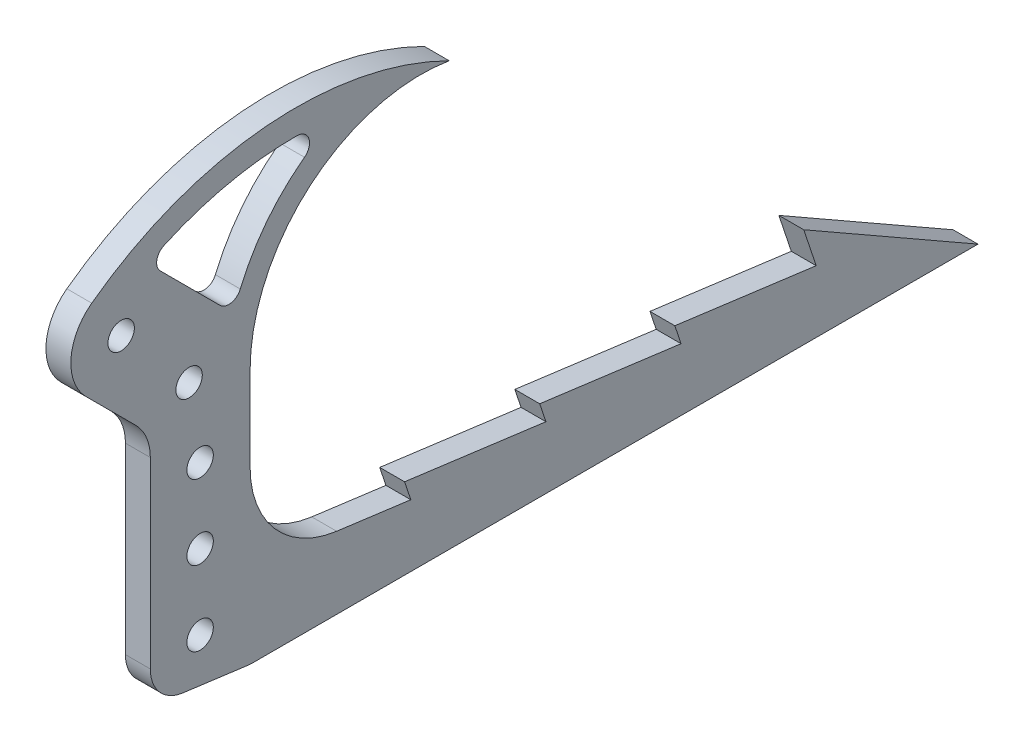
ISO-10303-21;
HEADER;
FILE_DESCRIPTION(('STEP AP214'),'2;1');
FILE_NAME('part.step','',(''),(''),'','','');
FILE_SCHEMA(('AUTOMOTIVE_DESIGN { 1 0 10303 214 1 1 1 1 }'));
ENDSEC;
DATA;
#1=APPLICATION_CONTEXT('core data for automotive mechanical design processes');
#2=APPLICATION_PROTOCOL_DEFINITION('international standard','automotive_design',2000,#1);
#3=PRODUCT_CONTEXT('',#1,'mechanical');
#4=PRODUCT('Part','Part','',(#3));
#5=PRODUCT_RELATED_PRODUCT_CATEGORY('part','',(#4));
#6=PRODUCT_DEFINITION_FORMATION('','',#4);
#7=PRODUCT_DEFINITION_CONTEXT('part definition',#1,'design');
#8=PRODUCT_DEFINITION('design','',#6,#7);
#9=PRODUCT_DEFINITION_SHAPE('','',#8);
#10=(LENGTH_UNIT() NAMED_UNIT(*) SI_UNIT(.MILLI.,.METRE.));
#11=(NAMED_UNIT(*) PLANE_ANGLE_UNIT() SI_UNIT($,.RADIAN.));
#12=(NAMED_UNIT(*) SI_UNIT($,.STERADIAN.) SOLID_ANGLE_UNIT());
#13=UNCERTAINTY_MEASURE_WITH_UNIT(LENGTH_MEASURE(1.E-05),#10,'distance_accuracy_value','');
#14=(GEOMETRIC_REPRESENTATION_CONTEXT(3) GLOBAL_UNCERTAINTY_ASSIGNED_CONTEXT((#13)) GLOBAL_UNIT_ASSIGNED_CONTEXT((#10,
#11,#12)) REPRESENTATION_CONTEXT('',''));
#15=CARTESIAN_POINT('',(0.,0.,0.));
#16=DIRECTION('',(0.,0.,1.));
#17=DIRECTION('',(1.,0.,0.));
#18=AXIS2_PLACEMENT_3D('',#15,#16,#17);
#19=CARTESIAN_POINT('',(12.7,0.,0.));
#20=DIRECTION('',(1.,0.,0.));
#21=DIRECTION('',(0.,0.,-1.));
#22=AXIS2_PLACEMENT_3D('',#19,#20,#21);
#23=PLANE('',#22);
#24=CARTESIAN_POINT('',(12.7,-234.95,-365.125));
#25=DIRECTION('',(1.,0.,0.));
#26=DIRECTION('',(0.,0.,-1.));
#27=AXIS2_PLACEMENT_3D('',#24,#25,#26);
#28=CIRCLE('',#27,6.74623999999999);
#29=CARTESIAN_POINT('',(12.7,-234.95,-371.87124));
#30=VERTEX_POINT('',#29);
#31=EDGE_CURVE('E329',#30,#30,#28,.T.);
#32=ORIENTED_EDGE('',*,*,#31,.F.);
#33=EDGE_LOOP('',(#32));
#34=FACE_BOUND('',#33,.T.);
#35=CARTESIAN_POINT('',(12.7,-196.85,-365.125));
#36=DIRECTION('',(1.,0.,0.));
#37=DIRECTION('',(0.,0.,-1.));
#38=AXIS2_PLACEMENT_3D('',#35,#36,#37);
#39=CIRCLE('',#38,6.74623999999999);
#40=CARTESIAN_POINT('',(12.7,-196.85,-371.87124));
#41=VERTEX_POINT('',#40);
#42=EDGE_CURVE('E335',#41,#41,#39,.T.);
#43=ORIENTED_EDGE('',*,*,#42,.F.);
#44=EDGE_LOOP('',(#43));
#45=FACE_BOUND('',#44,.T.);
#46=CARTESIAN_POINT('',(12.7,-158.75,-365.125));
#47=DIRECTION('',(1.,0.,0.));
#48=DIRECTION('',(0.,0.,-1.));
#49=AXIS2_PLACEMENT_3D('',#46,#47,#48);
#50=CIRCLE('',#49,6.74623999999999);
#51=CARTESIAN_POINT('',(12.7,-158.75,-371.87124));
#52=VERTEX_POINT('',#51);
#53=EDGE_CURVE('E341',#52,#52,#50,.T.);
#54=ORIENTED_EDGE('',*,*,#53,.F.);
#55=EDGE_LOOP('',(#54));
#56=FACE_BOUND('',#55,.T.);
#57=CARTESIAN_POINT('',(12.7,-120.65,-359.507120599864));
#58=DIRECTION('',(1.,0.,0.));
#59=DIRECTION('',(0.,0.,-1.));
#60=AXIS2_PLACEMENT_3D('',#57,#58,#59);
#61=CIRCLE('',#60,6.74624);
#62=CARTESIAN_POINT('',(12.7,-120.65,-366.253360599864));
#63=VERTEX_POINT('',#62);
#64=EDGE_CURVE('E345',#63,#63,#61,.T.);
#65=ORIENTED_EDGE('',*,*,#64,.F.);
#66=EDGE_LOOP('',(#65));
#67=FACE_BOUND('',#66,.T.);
#68=CARTESIAN_POINT('',(12.7,-82.55,-324.846024484277));
#69=DIRECTION('',(1.,0.,0.));
#70=DIRECTION('',(0.,0.,-1.));
#71=AXIS2_PLACEMENT_3D('',#68,#69,#70);
#72=CIRCLE('',#71,6.74624);
#73=CARTESIAN_POINT('',(12.7,-82.55,-331.592264484277));
#74=VERTEX_POINT('',#73);
#75=EDGE_CURVE('E351',#74,#74,#72,.T.);
#76=ORIENTED_EDGE('',*,*,#75,.F.);
#77=EDGE_LOOP('',(#76));
#78=FACE_BOUND('',#77,.T.);
#79=DIRECTION('',(0.,1.,0.));
#80=VECTOR('',#79,1.);
#81=CARTESIAN_POINT('',(12.7,0.,-390.630407277116));
#82=LINE('',#81,#80);
#83=CARTESIAN_POINT('',(12.7,-173.612322638782,-390.630407277116));
#84=VERTEX_POINT('',#83);
#85=CARTESIAN_POINT('',(12.7,-130.809027211395,-390.630407277116));
#86=VERTEX_POINT('',#85);
#87=EDGE_CURVE('E240',#84,#86,#82,.T.);
#88=ORIENTED_EDGE('',*,*,#87,.T.);
#89=CARTESIAN_POINT('',(12.7,-130.809027211395,-477.815853245172));
#90=DIRECTION('',(-1.,0.,0.));
#91=DIRECTION('',(0.,0.,-1.));
#92=AXIS2_PLACEMENT_3D('',#89,#90,#91);
#93=CIRCLE('',#92,87.1854459680564);
#94=CARTESIAN_POINT('',(12.7,-44.8234317857134,-492.230407277116));
#95=VERTEX_POINT('',#94);
#96=EDGE_CURVE('E223',#86,#95,#93,.T.);
#97=ORIENTED_EDGE('',*,*,#96,.T.);
#98=CARTESIAN_POINT('',(12.7,-201.477062264651,-413.996069504142));
#99=DIRECTION('',(1.,0.,0.));
#100=DIRECTION('',(0.,0.,1.));
#101=AXIS2_PLACEMENT_3D('',#98,#99,#100);
#102=CIRCLE('',#101,175.102745692371);
#103=CARTESIAN_POINT('',(12.7,-60.7181110577809,-309.842868861295));
#104=VERTEX_POINT('',#103);
#105=EDGE_CURVE('E232',#95,#104,#102,.T.);
#106=ORIENTED_EDGE('',*,*,#105,.T.);
#107=CARTESIAN_POINT('',(12.7,-81.8884049835699,-325.507619500707));
#108=DIRECTION('',(1.,0.,0.));
#109=DIRECTION('',(0.,0.,-1.));
#110=AXIS2_PLACEMENT_3D('',#107,#108,#109);
#111=CIRCLE('',#110,26.335636645034);
#112=CARTESIAN_POINT('',(12.7,-100.510512242138,-306.885512242138));
#113=VERTEX_POINT('',#112);
#114=EDGE_CURVE('E322',#104,#113,#111,.T.);
#115=ORIENTED_EDGE('',*,*,#114,.T.);
#116=DIRECTION('',(0.,-0.707106781186546,-0.707106781186549));
#117=VECTOR('',#116,1.);
#118=CARTESIAN_POINT('',(12.7,103.1875,-103.187499999999));
#119=LINE('',#118,#117);
#120=CARTESIAN_POINT('',(12.7,-125.910512242138,-332.285512242138));
#121=VERTEX_POINT('',#120);
#122=EDGE_CURVE('E355',#113,#121,#119,.T.);
#123=ORIENTED_EDGE('',*,*,#122,.T.);
#124=CARTESIAN_POINT('',(12.7,-143.871024484277,-314.325));
#125=DIRECTION('',(1.,0.,0.));
#126=DIRECTION('',(0.,0.,-1.));
#127=AXIS2_PLACEMENT_3D('',#124,#125,#126);
#128=CIRCLE('',#127,25.4);
#129=CARTESIAN_POINT('',(12.7,-143.871024484277,-339.725));
#130=VERTEX_POINT('',#129);
#131=EDGE_CURVE('E377',#121,#130,#128,.F.);
#132=ORIENTED_EDGE('',*,*,#131,.T.);
#133=DIRECTION('',(0.,-1.,0.));
#134=VECTOR('',#133,1.);
#135=CARTESIAN_POINT('',(12.7,-1.56307715309068E-13,-339.725));
#136=LINE('',#135,#134);
#137=CARTESIAN_POINT('',(12.7,-237.300627392844,-339.725));
#138=VERTEX_POINT('',#137);
#139=EDGE_CURVE('E357',#130,#138,#136,.T.);
#140=ORIENTED_EDGE('',*,*,#139,.T.);
#141=CARTESIAN_POINT('',(12.7,-237.300627392844,-358.775));
#142=DIRECTION('',(1.,0.,0.));
#143=DIRECTION('',(0.,0.,-1.));
#144=AXIS2_PLACEMENT_3D('',#141,#142,#143);
#145=CIRCLE('',#144,19.05);
#146=CARTESIAN_POINT('',(12.7,-256.186612944308,-356.280596313767));
#147=VERTEX_POINT('',#146);
#148=EDGE_CURVE('E391',#138,#147,#145,.T.);
#149=ORIENTED_EDGE('',*,*,#148,.T.);
#150=DIRECTION('',(0.,-0.130939826048985,-0.991390317662151));
#151=VECTOR('',#150,1.);
#152=CARTESIAN_POINT('',(12.7,-254.,-339.725));
#153=LINE('',#152,#151);
#154=CARTESIAN_POINT('',(12.7,-260.559417337177,-389.388597652483));
#155=VERTEX_POINT('',#154);
#156=EDGE_CURVE('E269',#147,#155,#153,.T.);
#157=ORIENTED_EDGE('',*,*,#156,.T.);
#158=CARTESIAN_POINT('',(12.7,-241.673431785713,-391.883001338717));
#159=DIRECTION('',(1.,0.,0.));
#160=DIRECTION('',(0.,0.,-1.));
#161=AXIS2_PLACEMENT_3D('',#158,#159,#160);
#162=CIRCLE('',#161,19.05);
#163=CARTESIAN_POINT('',(12.7,-260.723431785713,-391.883001338717));
#164=VERTEX_POINT('',#163);
#165=EDGE_CURVE('E393',#155,#164,#162,.T.);
#166=ORIENTED_EDGE('',*,*,#165,.T.);
#167=DIRECTION('',(0.,0.,-1.));
#168=VECTOR('',#167,1.);
#169=CARTESIAN_POINT('',(12.7,-260.723431785713,-390.630407277116));
#170=LINE('',#169,#168);
#171=CARTESIAN_POINT('',(12.7,-260.723431785713,-762.));
#172=VERTEX_POINT('',#171);
#173=EDGE_CURVE('E272',#164,#172,#170,.T.);
#174=ORIENTED_EDGE('',*,*,#173,.T.);
#175=DIRECTION('',(0.,0.496138938356834,0.868243142124459));
#176=VECTOR('',#175,1.);
#177=CARTESIAN_POINT('',(12.7,-260.723431785713,-762.));
#178=LINE('',#177,#176);
#179=CARTESIAN_POINT('',(12.7,-209.923431785713,-673.1));
#180=VERTEX_POINT('',#179);
#181=EDGE_CURVE('E275',#172,#180,#178,.T.);
#182=ORIENTED_EDGE('',*,*,#181,.T.);
#183=DIRECTION('',(0.,-0.948683298050514,-0.316227766016836));
#184=VECTOR('',#183,1.);
#185=CARTESIAN_POINT('',(12.7,-209.923431785713,-673.1));
#186=LINE('',#185,#184);
#187=CARTESIAN_POINT('',(12.7,-228.973431785713,-679.45));
#188=VERTEX_POINT('',#187);
#189=EDGE_CURVE('E278',#180,#188,#186,.T.);
#190=ORIENTED_EDGE('',*,*,#189,.T.);
#191=DIRECTION('',(0.,0.130939826048984,0.991390317662151));
#192=VECTOR('',#191,1.);
#193=CARTESIAN_POINT('',(12.7,-228.973431785713,-679.45));
#194=LINE('',#193,#192);
#195=CARTESIAN_POINT('',(12.7,-219.448431785713,-607.332959213651));
#196=VERTEX_POINT('',#195);
#197=EDGE_CURVE('E281',#188,#196,#194,.T.);
#198=ORIENTED_EDGE('',*,*,#197,.T.);
#199=DIRECTION('',(0.,-0.948683298050503,-0.31622776601687));
#200=VECTOR('',#199,1.);
#201=CARTESIAN_POINT('',(12.7,-219.448431785713,-607.332959213651));
#202=LINE('',#201,#200);
#203=CARTESIAN_POINT('',(12.7,-228.973431785713,-610.507959213651));
#204=VERTEX_POINT('',#203);
#205=EDGE_CURVE('E284',#196,#204,#202,.T.);
#206=ORIENTED_EDGE('',*,*,#205,.T.);
#207=DIRECTION('',(0.,0.130939826048984,0.991390317662152));
#208=VECTOR('',#207,1.);
#209=CARTESIAN_POINT('',(12.7,-228.973431785713,-610.507959213651));
#210=LINE('',#209,#208);
#211=CARTESIAN_POINT('',(12.7,-219.448431785713,-538.390918427302));
#212=VERTEX_POINT('',#211);
#213=EDGE_CURVE('E287',#204,#212,#210,.T.);
#214=ORIENTED_EDGE('',*,*,#213,.T.);
#215=DIRECTION('',(0.,-0.948683298050506,-0.31622776601686));
#216=VECTOR('',#215,1.);
#217=CARTESIAN_POINT('',(12.7,-219.448431785713,-538.390918427302));
#218=LINE('',#217,#216);
#219=CARTESIAN_POINT('',(12.7,-228.973431785713,-541.565918427303));
#220=VERTEX_POINT('',#219);
#221=EDGE_CURVE('E290',#212,#220,#218,.T.);
#222=ORIENTED_EDGE('',*,*,#221,.T.);
#223=DIRECTION('',(0.,0.130939826048984,0.991390317662151));
#224=VECTOR('',#223,1.);
#225=CARTESIAN_POINT('',(12.7,-228.973431785713,-541.565918427303));
#226=LINE('',#225,#224);
#227=CARTESIAN_POINT('',(12.7,-219.448431785713,-469.448877640954));
#228=VERTEX_POINT('',#227);
#229=EDGE_CURVE('E293',#220,#228,#226,.T.);
#230=ORIENTED_EDGE('',*,*,#229,.T.);
#231=DIRECTION('',(0.,-0.948683298050515,-0.316227766016835));
#232=VECTOR('',#231,1.);
#233=CARTESIAN_POINT('',(12.7,-219.448431785713,-469.448877640954));
#234=LINE('',#233,#232);
#235=CARTESIAN_POINT('',(12.7,-228.973431785713,-472.623877640954));
#236=VERTEX_POINT('',#235);
#237=EDGE_CURVE('E296',#228,#236,#234,.T.);
#238=ORIENTED_EDGE('',*,*,#237,.T.);
#239=DIRECTION('',(0.,0.130939826048984,0.991390317662151));
#240=VECTOR('',#239,1.);
#241=CARTESIAN_POINT('',(12.7,-219.448431785713,-400.506836854605));
#242=LINE('',#241,#240);
#243=CARTESIAN_POINT('',(12.7,-223.97495077602,-434.778664113827));
#244=VERTEX_POINT('',#243);
#245=EDGE_CURVE('E299',#236,#244,#242,.T.);
#246=ORIENTED_EDGE('',*,*,#245,.T.);
#247=CARTESIAN_POINT('',(12.7,-173.612322638782,-441.430407277116));
#248=DIRECTION('',(1.,0.,0.));
#249=DIRECTION('',(0.,0.,-1.));
#250=AXIS2_PLACEMENT_3D('',#247,#248,#249);
#251=CIRCLE('',#250,50.8);
#252=EDGE_CURVE('E408',#244,#84,#251,.F.);
#253=ORIENTED_EDGE('',*,*,#252,.T.);
#254=EDGE_LOOP('',(#88,#97,#106,#115,#123,#132,#140,#149,#157,#166,#174,#182,#190,#198,#206,
#214,#222,#230,#238,#246,#253));
#255=FACE_BOUND('',#254,.T.);
#256=CARTESIAN_POINT('',(12.7,-201.477062264651,-413.996069504142));
#257=DIRECTION('',(1.,0.,0.));
#258=DIRECTION('',(0.,0.,-1.));
#259=AXIS2_PLACEMENT_3D('',#256,#257,#258);
#260=CIRCLE('',#259,162.402745692371);
#261=CARTESIAN_POINT('',(12.7,-39.0755525823779,-414.629679273333));
#262=VERTEX_POINT('',#261);
#263=CARTESIAN_POINT('',(12.7,-53.6848848416106,-346.675017068982));
#264=VERTEX_POINT('',#263);
#265=EDGE_CURVE('E434',#262,#264,#260,.T.);
#266=ORIENTED_EDGE('',*,*,#265,.F.);
#267=CARTESIAN_POINT('',(12.7,-45.4255042539824,-414.604904925971));
#268=DIRECTION('',(1.,0.,0.));
#269=DIRECTION('',(0.,0.,-1.));
#270=AXIS2_PLACEMENT_3D('',#267,#268,#269);
#271=CIRCLE('',#270,6.35);
#272=CARTESIAN_POINT('',(12.7,-50.52912448016,-418.383206209213));
#273=VERTEX_POINT('',#272);
#274=EDGE_CURVE('E430',#262,#273,#271,.F.);
#275=ORIENTED_EDGE('',*,*,#274,.T.);
#276=CARTESIAN_POINT('',(12.7,-130.809027211395,-477.815853245172));
#277=DIRECTION('',(1.,0.,0.));
#278=DIRECTION('',(0.,0.,-1.));
#279=AXIS2_PLACEMENT_3D('',#276,#277,#278);
#280=CIRCLE('',#279,99.8854459680564);
#281=CARTESIAN_POINT('',(12.7,-92.3646314642323,-385.625122952626));
#282=VERTEX_POINT('',#281);
#283=EDGE_CURVE('E441',#273,#282,#280,.T.);
#284=ORIENTED_EDGE('',*,*,#283,.T.);
#285=CARTESIAN_POINT('',(12.7,-89.9206126121509,-379.764297767494));
#286=DIRECTION('',(1.,0.,0.));
#287=DIRECTION('',(0.,0.,-1.));
#288=AXIS2_PLACEMENT_3D('',#285,#286,#287);
#289=CIRCLE('',#288,6.35);
#290=CARTESIAN_POINT('',(12.7,-94.4107406726855,-375.27416970696));
#291=VERTEX_POINT('',#290);
#292=EDGE_CURVE('E426',#282,#291,#289,.F.);
#293=ORIENTED_EDGE('',*,*,#292,.T.);
#294=DIRECTION('',(0.,-0.707106781186546,-0.707106781186549));
#295=VECTOR('',#294,1.);
#296=CARTESIAN_POINT('',(12.7,140.431714517137,-140.431714517136));
#297=LINE('',#296,#295);
#298=CARTESIAN_POINT('',(12.7,-63.9537349467466,-344.817163981021));
#299=VERTEX_POINT('',#298);
#300=EDGE_CURVE('E436',#299,#291,#297,.T.);
#301=ORIENTED_EDGE('',*,*,#300,.F.);
#302=CARTESIAN_POINT('',(12.7,-59.463606886212,-349.307292041555));
#303=DIRECTION('',(1.,0.,0.));
#304=DIRECTION('',(0.,0.,-1.));
#305=AXIS2_PLACEMENT_3D('',#302,#303,#304);
#306=CIRCLE('',#305,6.35);
#307=EDGE_CURVE('E45',#299,#264,#306,.F.);
#308=ORIENTED_EDGE('',*,*,#307,.T.);
#309=EDGE_LOOP('',(#266,#275,#284,#293,#301,#308));
#310=FACE_BOUND('',#309,.T.);
#311=ADVANCED_FACE('F37',(#34,#45,#56,#67,#78,#255,#310),#23,.T.);
#312=CARTESIAN_POINT('',(0.,0.,0.));
#313=DIRECTION('',(1.,0.,0.));
#314=DIRECTION('',(0.,0.,-1.));
#315=AXIS2_PLACEMENT_3D('',#312,#313,#314);
#316=PLANE('',#315);
#317=CARTESIAN_POINT('',(0.,-234.95,-365.125));
#318=DIRECTION('',(1.,0.,0.));
#319=DIRECTION('',(0.,0.,-1.));
#320=AXIS2_PLACEMENT_3D('',#317,#318,#319);
#321=CIRCLE('',#320,6.74623999999999);
#322=CARTESIAN_POINT('',(0.,-234.95,-371.87124));
#323=VERTEX_POINT('',#322);
#324=EDGE_CURVE('E332',#323,#323,#321,.T.);
#325=ORIENTED_EDGE('',*,*,#324,.T.);
#326=EDGE_LOOP('',(#325));
#327=FACE_BOUND('',#326,.T.);
#328=CARTESIAN_POINT('',(0.,-196.85,-365.125));
#329=DIRECTION('',(1.,0.,0.));
#330=DIRECTION('',(0.,0.,-1.));
#331=AXIS2_PLACEMENT_3D('',#328,#329,#330);
#332=CIRCLE('',#331,6.74623999999999);
#333=CARTESIAN_POINT('',(0.,-196.85,-371.87124));
#334=VERTEX_POINT('',#333);
#335=EDGE_CURVE('E338',#334,#334,#332,.T.);
#336=ORIENTED_EDGE('',*,*,#335,.T.);
#337=EDGE_LOOP('',(#336));
#338=FACE_BOUND('',#337,.T.);
#339=CARTESIAN_POINT('',(0.,-158.75,-365.125));
#340=DIRECTION('',(1.,0.,0.));
#341=DIRECTION('',(0.,0.,-1.));
#342=AXIS2_PLACEMENT_3D('',#339,#340,#341);
#343=CIRCLE('',#342,6.74623999999999);
#344=CARTESIAN_POINT('',(0.,-158.75,-371.87124));
#345=VERTEX_POINT('',#344);
#346=EDGE_CURVE('E344',#345,#345,#343,.T.);
#347=ORIENTED_EDGE('',*,*,#346,.T.);
#348=EDGE_LOOP('',(#347));
#349=FACE_BOUND('',#348,.T.);
#350=CARTESIAN_POINT('',(0.,-120.65,-359.507120599864));
#351=DIRECTION('',(1.,0.,0.));
#352=DIRECTION('',(0.,0.,-1.));
#353=AXIS2_PLACEMENT_3D('',#350,#351,#352);
#354=CIRCLE('',#353,6.74623999999999);
#355=CARTESIAN_POINT('',(0.,-120.65,-366.253360599864));
#356=VERTEX_POINT('',#355);
#357=EDGE_CURVE('E348',#356,#356,#354,.T.);
#358=ORIENTED_EDGE('',*,*,#357,.T.);
#359=EDGE_LOOP('',(#358));
#360=FACE_BOUND('',#359,.T.);
#361=CARTESIAN_POINT('',(0.,-82.55,-324.846024484277));
#362=DIRECTION('',(1.,0.,0.));
#363=DIRECTION('',(0.,0.,-1.));
#364=AXIS2_PLACEMENT_3D('',#361,#362,#363);
#365=CIRCLE('',#364,6.74623999999999);
#366=CARTESIAN_POINT('',(0.,-82.55,-331.592264484277));
#367=VERTEX_POINT('',#366);
#368=EDGE_CURVE('E354',#367,#367,#365,.T.);
#369=ORIENTED_EDGE('',*,*,#368,.T.);
#370=EDGE_LOOP('',(#369));
#371=FACE_BOUND('',#370,.T.);
#372=CARTESIAN_POINT('',(0.,-130.809027211395,-477.815853245172));
#373=DIRECTION('',(1.,0.,0.));
#374=DIRECTION('',(0.,0.,-1.));
#375=AXIS2_PLACEMENT_3D('',#372,#373,#374);
#376=CIRCLE('',#375,87.1854459680564);
#377=CARTESIAN_POINT('',(0.,-44.8234317857134,-492.230407277116));
#378=VERTEX_POINT('',#377);
#379=CARTESIAN_POINT('',(0.,-130.809027211395,-390.630407277116));
#380=VERTEX_POINT('',#379);
#381=EDGE_CURVE('E225',#378,#380,#376,.T.);
#382=ORIENTED_EDGE('',*,*,#381,.T.);
#383=DIRECTION('',(0.,1.,0.));
#384=VECTOR('',#383,1.);
#385=CARTESIAN_POINT('',(0.,0.,-390.630407277116));
#386=LINE('',#385,#384);
#387=CARTESIAN_POINT('',(0.,-173.612322638782,-390.630407277116));
#388=VERTEX_POINT('',#387);
#389=EDGE_CURVE('E358',#388,#380,#386,.T.);
#390=ORIENTED_EDGE('',*,*,#389,.F.);
#391=CARTESIAN_POINT('',(0.,-173.612322638782,-441.430407277116));
#392=DIRECTION('',(1.,0.,0.));
#393=DIRECTION('',(0.,0.,-1.));
#394=AXIS2_PLACEMENT_3D('',#391,#392,#393);
#395=CIRCLE('',#394,50.8);
#396=CARTESIAN_POINT('',(0.,-223.97495077602,-434.778664113827));
#397=VERTEX_POINT('',#396);
#398=EDGE_CURVE('E410',#388,#397,#395,.T.);
#399=ORIENTED_EDGE('',*,*,#398,.T.);
#400=DIRECTION('',(0.,-0.130939826048984,-0.991390317662152));
#401=VECTOR('',#400,1.);
#402=CARTESIAN_POINT('',(0.,-219.448431785713,-400.506836854605));
#403=LINE('',#402,#401);
#404=CARTESIAN_POINT('',(0.,-228.973431785713,-472.623877640954));
#405=VERTEX_POINT('',#404);
#406=EDGE_CURVE('E266',#397,#405,#403,.T.);
#407=ORIENTED_EDGE('',*,*,#406,.T.);
#408=DIRECTION('',(0.,0.948683298050515,0.316227766016835));
#409=VECTOR('',#408,1.);
#410=CARTESIAN_POINT('',(0.,-219.448431785713,-469.448877640954));
#411=LINE('',#410,#409);
#412=CARTESIAN_POINT('',(0.,-219.448431785713,-469.448877640954));
#413=VERTEX_POINT('',#412);
#414=EDGE_CURVE('E264',#405,#413,#411,.T.);
#415=ORIENTED_EDGE('',*,*,#414,.T.);
#416=DIRECTION('',(0.,-0.130939826048984,-0.991390317662152));
#417=VECTOR('',#416,1.);
#418=CARTESIAN_POINT('',(0.,-228.973431785713,-541.565918427303));
#419=LINE('',#418,#417);
#420=CARTESIAN_POINT('',(0.,-228.973431785713,-541.565918427303));
#421=VERTEX_POINT('',#420);
#422=EDGE_CURVE('E262',#413,#421,#419,.T.);
#423=ORIENTED_EDGE('',*,*,#422,.T.);
#424=DIRECTION('',(0.,0.948683298050506,0.31622776601686));
#425=VECTOR('',#424,1.);
#426=CARTESIAN_POINT('',(0.,-219.448431785713,-538.390918427302));
#427=LINE('',#426,#425);
#428=CARTESIAN_POINT('',(0.,-219.448431785713,-538.390918427302));
#429=VERTEX_POINT('',#428);
#430=EDGE_CURVE('E260',#421,#429,#427,.T.);
#431=ORIENTED_EDGE('',*,*,#430,.T.);
#432=DIRECTION('',(0.,-0.130939826048984,-0.991390317662152));
#433=VECTOR('',#432,1.);
#434=CARTESIAN_POINT('',(0.,-228.973431785713,-610.507959213651));
#435=LINE('',#434,#433);
#436=CARTESIAN_POINT('',(0.,-228.973431785713,-610.507959213651));
#437=VERTEX_POINT('',#436);
#438=EDGE_CURVE('E258',#429,#437,#435,.T.);
#439=ORIENTED_EDGE('',*,*,#438,.T.);
#440=DIRECTION('',(0.,0.948683298050503,0.31622776601687));
#441=VECTOR('',#440,1.);
#442=CARTESIAN_POINT('',(0.,-219.448431785713,-607.332959213651));
#443=LINE('',#442,#441);
#444=CARTESIAN_POINT('',(0.,-219.448431785713,-607.332959213651));
#445=VERTEX_POINT('',#444);
#446=EDGE_CURVE('E256',#437,#445,#443,.T.);
#447=ORIENTED_EDGE('',*,*,#446,.T.);
#448=DIRECTION('',(0.,-0.130939826048984,-0.991390317662152));
#449=VECTOR('',#448,1.);
#450=CARTESIAN_POINT('',(0.,-228.973431785713,-679.45));
#451=LINE('',#450,#449);
#452=CARTESIAN_POINT('',(0.,-228.973431785713,-679.45));
#453=VERTEX_POINT('',#452);
#454=EDGE_CURVE('E254',#445,#453,#451,.T.);
#455=ORIENTED_EDGE('',*,*,#454,.T.);
#456=DIRECTION('',(0.,0.948683298050514,0.316227766016836));
#457=VECTOR('',#456,1.);
#458=CARTESIAN_POINT('',(0.,-209.923431785713,-673.1));
#459=LINE('',#458,#457);
#460=CARTESIAN_POINT('',(0.,-209.923431785713,-673.1));
#461=VERTEX_POINT('',#460);
#462=EDGE_CURVE('E252',#453,#461,#459,.T.);
#463=ORIENTED_EDGE('',*,*,#462,.T.);
#464=DIRECTION('',(0.,-0.496138938356834,-0.868243142124459));
#465=VECTOR('',#464,1.);
#466=CARTESIAN_POINT('',(0.,-260.723431785713,-762.));
#467=LINE('',#466,#465);
#468=CARTESIAN_POINT('',(0.,-260.723431785713,-762.));
#469=VERTEX_POINT('',#468);
#470=EDGE_CURVE('E249',#461,#469,#467,.T.);
#471=ORIENTED_EDGE('',*,*,#470,.T.);
#472=DIRECTION('',(0.,0.,1.));
#473=VECTOR('',#472,1.);
#474=CARTESIAN_POINT('',(0.,-260.723431785713,-390.630407277116));
#475=LINE('',#474,#473);
#476=CARTESIAN_POINT('',(0.,-260.723431785713,-391.883001338717));
#477=VERTEX_POINT('',#476);
#478=EDGE_CURVE('E246',#469,#477,#475,.T.);
#479=ORIENTED_EDGE('',*,*,#478,.T.);
#480=CARTESIAN_POINT('',(0.,-241.673431785713,-391.883001338717));
#481=DIRECTION('',(1.,0.,0.));
#482=DIRECTION('',(0.,0.,-1.));
#483=AXIS2_PLACEMENT_3D('',#480,#481,#482);
#484=CIRCLE('',#483,19.05);
#485=CARTESIAN_POINT('',(0.,-260.559417337177,-389.388597652483));
#486=VERTEX_POINT('',#485);
#487=EDGE_CURVE('E399',#477,#486,#484,.F.);
#488=ORIENTED_EDGE('',*,*,#487,.T.);
#489=DIRECTION('',(0.,0.130939826048985,0.991390317662152));
#490=VECTOR('',#489,1.);
#491=CARTESIAN_POINT('',(0.,-254.,-339.725));
#492=LINE('',#491,#490);
#493=CARTESIAN_POINT('',(0.,-256.186612944308,-356.280596313767));
#494=VERTEX_POINT('',#493);
#495=EDGE_CURVE('E268',#486,#494,#492,.T.);
#496=ORIENTED_EDGE('',*,*,#495,.T.);
#497=CARTESIAN_POINT('',(0.,-237.300627392844,-358.775));
#498=DIRECTION('',(1.,0.,0.));
#499=DIRECTION('',(0.,0.,-1.));
#500=AXIS2_PLACEMENT_3D('',#497,#498,#499);
#501=CIRCLE('',#500,19.05);
#502=CARTESIAN_POINT('',(0.,-237.300627392844,-339.725));
#503=VERTEX_POINT('',#502);
#504=EDGE_CURVE('E397',#494,#503,#501,.F.);
#505=ORIENTED_EDGE('',*,*,#504,.T.);
#506=DIRECTION('',(0.,-1.,0.));
#507=VECTOR('',#506,1.);
#508=CARTESIAN_POINT('',(0.,-1.56307715309068E-13,-339.725));
#509=LINE('',#508,#507);
#510=CARTESIAN_POINT('',(0.,-143.871024484277,-339.725));
#511=VERTEX_POINT('',#510);
#512=EDGE_CURVE('E365',#511,#503,#509,.T.);
#513=ORIENTED_EDGE('',*,*,#512,.F.);
#514=CARTESIAN_POINT('',(0.,-143.871024484277,-314.325));
#515=DIRECTION('',(1.,0.,0.));
#516=DIRECTION('',(0.,0.,-1.));
#517=AXIS2_PLACEMENT_3D('',#514,#515,#516);
#518=CIRCLE('',#517,25.4);
#519=CARTESIAN_POINT('',(0.,-125.910512242138,-332.285512242138));
#520=VERTEX_POINT('',#519);
#521=EDGE_CURVE('E374',#511,#520,#518,.T.);
#522=ORIENTED_EDGE('',*,*,#521,.T.);
#523=DIRECTION('',(0.,-0.707106781186546,-0.707106781186549));
#524=VECTOR('',#523,1.);
#525=CARTESIAN_POINT('',(0.,103.1875,-103.187499999999));
#526=LINE('',#525,#524);
#527=CARTESIAN_POINT('',(0.,-100.510512242138,-306.885512242138));
#528=VERTEX_POINT('',#527);
#529=EDGE_CURVE('E363',#528,#520,#526,.T.);
#530=ORIENTED_EDGE('',*,*,#529,.F.);
#531=CARTESIAN_POINT('',(0.,-81.8884049835699,-325.507619500707));
#532=DIRECTION('',(1.,0.,0.));
#533=DIRECTION('',(0.,0.,-1.));
#534=AXIS2_PLACEMENT_3D('',#531,#532,#533);
#535=CIRCLE('',#534,26.335636645034);
#536=CARTESIAN_POINT('',(0.,-60.7181110577809,-309.842868861295));
#537=VERTEX_POINT('',#536);
#538=EDGE_CURVE('E323',#537,#528,#535,.T.);
#539=ORIENTED_EDGE('',*,*,#538,.F.);
#540=CARTESIAN_POINT('',(0.,-201.477062264651,-413.996069504142));
#541=DIRECTION('',(1.,0.,0.));
#542=DIRECTION('',(0.,0.,-1.));
#543=AXIS2_PLACEMENT_3D('',#540,#541,#542);
#544=CIRCLE('',#543,175.102745692371);
#545=EDGE_CURVE('E273',#537,#378,#544,.F.);
#546=ORIENTED_EDGE('',*,*,#545,.T.);
#547=EDGE_LOOP('',(#382,#390,#399,#407,#415,#423,#431,#439,#447,#455,#463,#471,#479,#488,#496,
#505,#513,#522,#530,#539,#546));
#548=FACE_BOUND('',#547,.T.);
#549=CARTESIAN_POINT('',(0.,-130.809027211395,-477.815853245172));
#550=DIRECTION('',(1.,0.,0.));
#551=DIRECTION('',(0.,0.,-1.));
#552=AXIS2_PLACEMENT_3D('',#549,#550,#551);
#553=CIRCLE('',#552,99.8854459680564);
#554=CARTESIAN_POINT('',(0.,-50.52912448016,-418.383206209213));
#555=VERTEX_POINT('',#554);
#556=CARTESIAN_POINT('',(0.,-92.3646314642323,-385.625122952626));
#557=VERTEX_POINT('',#556);
#558=EDGE_CURVE('E453',#555,#557,#553,.T.);
#559=ORIENTED_EDGE('',*,*,#558,.F.);
#560=CARTESIAN_POINT('',(0.,-45.4255042539824,-414.604904925971));
#561=DIRECTION('',(1.,0.,0.));
#562=DIRECTION('',(0.,0.,-1.));
#563=AXIS2_PLACEMENT_3D('',#560,#561,#562);
#564=CIRCLE('',#563,6.35);
#565=CARTESIAN_POINT('',(0.,-39.0755525823779,-414.629679273333));
#566=VERTEX_POINT('',#565);
#567=EDGE_CURVE('E59',#555,#566,#564,.T.);
#568=ORIENTED_EDGE('',*,*,#567,.T.);
#569=CARTESIAN_POINT('',(0.,-201.477062264651,-413.996069504142));
#570=DIRECTION('',(1.,0.,0.));
#571=DIRECTION('',(0.,0.,-1.));
#572=AXIS2_PLACEMENT_3D('',#569,#570,#571);
#573=CIRCLE('',#572,162.402745692371);
#574=CARTESIAN_POINT('',(0.,-53.6848848416106,-346.675017068982));
#575=VERTEX_POINT('',#574);
#576=EDGE_CURVE('E448',#566,#575,#573,.T.);
#577=ORIENTED_EDGE('',*,*,#576,.T.);
#578=CARTESIAN_POINT('',(0.,-59.463606886212,-349.307292041555));
#579=DIRECTION('',(1.,0.,0.));
#580=DIRECTION('',(0.,0.,-1.));
#581=AXIS2_PLACEMENT_3D('',#578,#579,#580);
#582=CIRCLE('',#581,6.35);
#583=CARTESIAN_POINT('',(0.,-63.9537349467466,-344.817163981021));
#584=VERTEX_POINT('',#583);
#585=EDGE_CURVE('E11',#575,#584,#582,.T.);
#586=ORIENTED_EDGE('',*,*,#585,.T.);
#587=DIRECTION('',(0.,-0.707106781186546,-0.707106781186549));
#588=VECTOR('',#587,1.);
#589=CARTESIAN_POINT('',(0.,140.431714517137,-140.431714517136));
#590=LINE('',#589,#588);
#591=CARTESIAN_POINT('',(0.,-94.4107406726855,-375.27416970696));
#592=VERTEX_POINT('',#591);
#593=EDGE_CURVE('E236',#584,#592,#590,.T.);
#594=ORIENTED_EDGE('',*,*,#593,.T.);
#595=CARTESIAN_POINT('',(0.,-89.9206126121509,-379.764297767494));
#596=DIRECTION('',(1.,0.,0.));
#597=DIRECTION('',(0.,0.,-1.));
#598=AXIS2_PLACEMENT_3D('',#595,#596,#597);
#599=CIRCLE('',#598,6.35);
#600=EDGE_CURVE('E428',#592,#557,#599,.T.);
#601=ORIENTED_EDGE('',*,*,#600,.T.);
#602=EDGE_LOOP('',(#559,#568,#577,#586,#594,#601));
#603=FACE_BOUND('',#602,.T.);
#604=ADVANCED_FACE('F446',(#327,#338,#349,#360,#371,#548,#603),#316,.F.);
#605=CARTESIAN_POINT('',(12.7,103.1875,-103.187499999999));
#606=DIRECTION('',(0.,0.707106781186549,-0.707106781186546));
#607=DIRECTION('',(0.,0.707106781186546,0.707106781186549));
#608=AXIS2_PLACEMENT_3D('',#605,#606,#607);
#609=PLANE('',#608);
#610=DIRECTION('',(1.,0.,0.));
#611=VECTOR('',#610,1.);
#612=CARTESIAN_POINT('',(0.,-100.510512242138,-306.885512242138));
#613=LINE('',#612,#611);
#614=EDGE_CURVE('E325',#528,#113,#613,.T.);
#615=ORIENTED_EDGE('',*,*,#614,.F.);
#616=ORIENTED_EDGE('',*,*,#529,.T.);
#617=DIRECTION('',(-1.,0.,0.));
#618=VECTOR('',#617,1.);
#619=CARTESIAN_POINT('',(12.7,-125.910512242138,-332.285512242138));
#620=LINE('',#619,#618);
#621=EDGE_CURVE('E371',#520,#121,#620,.F.);
#622=ORIENTED_EDGE('',*,*,#621,.T.);
#623=ORIENTED_EDGE('',*,*,#122,.F.);
#624=EDGE_LOOP('',(#615,#616,#622,#623));
#625=FACE_BOUND('',#624,.T.);
#626=ADVANCED_FACE('F471',(#625),#609,.F.);
#627=CARTESIAN_POINT('',(12.7,-1.56307715309068E-13,-339.725));
#628=DIRECTION('',(0.,0.,-1.));
#629=DIRECTION('',(0.,1.,0.));
#630=AXIS2_PLACEMENT_3D('',#627,#628,#629);
#631=PLANE('',#630);
#632=ORIENTED_EDGE('',*,*,#512,.T.);
#633=DIRECTION('',(-1.,0.,0.));
#634=VECTOR('',#633,1.);
#635=CARTESIAN_POINT('',(12.7,-237.300627392844,-339.725));
#636=LINE('',#635,#634);
#637=EDGE_CURVE('E401',#503,#138,#636,.F.);
#638=ORIENTED_EDGE('',*,*,#637,.T.);
#639=ORIENTED_EDGE('',*,*,#139,.F.);
#640=DIRECTION('',(-1.,0.,0.));
#641=VECTOR('',#640,1.);
#642=CARTESIAN_POINT('',(0.,-143.871024484277,-339.725));
#643=LINE('',#642,#641);
#644=EDGE_CURVE('E362',#130,#511,#643,.T.);
#645=ORIENTED_EDGE('',*,*,#644,.T.);
#646=EDGE_LOOP('',(#632,#638,#639,#645));
#647=FACE_BOUND('',#646,.T.);
#648=ADVANCED_FACE('F477',(#647),#631,.F.);
#649=CARTESIAN_POINT('',(12.7,0.,-390.630407277116));
#650=DIRECTION('',(0.,0.,1.));
#651=DIRECTION('',(1.,0.,0.));
#652=AXIS2_PLACEMENT_3D('',#649,#650,#651);
#653=PLANE('',#652);
#654=ORIENTED_EDGE('',*,*,#87,.F.);
#655=DIRECTION('',(1.,0.,0.));
#656=VECTOR('',#655,1.);
#657=CARTESIAN_POINT('',(12.7,-173.612322638782,-390.630407277116));
#658=LINE('',#657,#656);
#659=EDGE_CURVE('E406',#84,#388,#658,.F.);
#660=ORIENTED_EDGE('',*,*,#659,.T.);
#661=ORIENTED_EDGE('',*,*,#389,.T.);
#662=DIRECTION('',(-1.,0.,0.));
#663=VECTOR('',#662,1.);
#664=CARTESIAN_POINT('',(12.7,-130.809027211395,-390.630407277116));
#665=LINE('',#664,#663);
#666=EDGE_CURVE('E379',#380,#86,#665,.F.);
#667=ORIENTED_EDGE('',*,*,#666,.T.);
#668=EDGE_LOOP('',(#654,#660,#661,#667));
#669=FACE_BOUND('',#668,.T.);
#670=ADVANCED_FACE('F547',(#669),#653,.F.);
#671=CARTESIAN_POINT('',(12.7,-143.871024484277,-314.325));
#672=DIRECTION('',(1.,0.,0.));
#673=DIRECTION('',(0.,0.,-1.));
#674=AXIS2_PLACEMENT_3D('',#671,#672,#673);
#675=CYLINDRICAL_SURFACE('',#674,25.4);
#676=ORIENTED_EDGE('',*,*,#131,.F.);
#677=ORIENTED_EDGE('',*,*,#621,.F.);
#678=ORIENTED_EDGE('',*,*,#521,.F.);
#679=ORIENTED_EDGE('',*,*,#644,.F.);
#680=EDGE_LOOP('',(#676,#677,#678,#679));
#681=FACE_BOUND('',#680,.T.);
#682=ADVANCED_FACE('F474',(#681),#675,.F.);
#683=CARTESIAN_POINT('',(12.7,-82.55,-324.846024484277));
#684=DIRECTION('',(1.,0.,0.));
#685=DIRECTION('',(0.,0.,-1.));
#686=AXIS2_PLACEMENT_3D('',#683,#684,#685);
#687=CYLINDRICAL_SURFACE('',#686,6.74623999999999);
#688=ORIENTED_EDGE('',*,*,#75,.T.);
#689=EDGE_LOOP('',(#688));
#690=FACE_BOUND('',#689,.T.);
#691=ORIENTED_EDGE('',*,*,#368,.F.);
#692=EDGE_LOOP('',(#691));
#693=FACE_BOUND('',#692,.T.);
#694=ADVANCED_FACE('F554',(#690,#693),#687,.F.);
#695=CARTESIAN_POINT('',(12.7,-120.65,-359.507120599864));
#696=DIRECTION('',(1.,0.,0.));
#697=DIRECTION('',(0.,0.,-1.));
#698=AXIS2_PLACEMENT_3D('',#695,#696,#697);
#699=CYLINDRICAL_SURFACE('',#698,6.74623999999999);
#700=ORIENTED_EDGE('',*,*,#64,.T.);
#701=EDGE_LOOP('',(#700));
#702=FACE_BOUND('',#701,.T.);
#703=ORIENTED_EDGE('',*,*,#357,.F.);
#704=EDGE_LOOP('',(#703));
#705=FACE_BOUND('',#704,.T.);
#706=ADVANCED_FACE('F570',(#702,#705),#699,.F.);
#707=CARTESIAN_POINT('',(12.7,-158.75,-365.125));
#708=DIRECTION('',(1.,0.,0.));
#709=DIRECTION('',(0.,0.,-1.));
#710=AXIS2_PLACEMENT_3D('',#707,#708,#709);
#711=CYLINDRICAL_SURFACE('',#710,6.74623999999999);
#712=ORIENTED_EDGE('',*,*,#53,.T.);
#713=EDGE_LOOP('',(#712));
#714=FACE_BOUND('',#713,.T.);
#715=ORIENTED_EDGE('',*,*,#346,.F.);
#716=EDGE_LOOP('',(#715));
#717=FACE_BOUND('',#716,.T.);
#718=ADVANCED_FACE('F574',(#714,#717),#711,.F.);
#719=CARTESIAN_POINT('',(12.7,-196.85,-365.125));
#720=DIRECTION('',(1.,0.,0.));
#721=DIRECTION('',(0.,0.,-1.));
#722=AXIS2_PLACEMENT_3D('',#719,#720,#721);
#723=CYLINDRICAL_SURFACE('',#722,6.74623999999999);
#724=ORIENTED_EDGE('',*,*,#42,.T.);
#725=EDGE_LOOP('',(#724));
#726=FACE_BOUND('',#725,.T.);
#727=ORIENTED_EDGE('',*,*,#335,.F.);
#728=EDGE_LOOP('',(#727));
#729=FACE_BOUND('',#728,.T.);
#730=ADVANCED_FACE('F578',(#726,#729),#723,.F.);
#731=CARTESIAN_POINT('',(12.7,-234.95,-365.125));
#732=DIRECTION('',(1.,0.,0.));
#733=DIRECTION('',(0.,0.,-1.));
#734=AXIS2_PLACEMENT_3D('',#731,#732,#733);
#735=CYLINDRICAL_SURFACE('',#734,6.74623999999999);
#736=ORIENTED_EDGE('',*,*,#31,.T.);
#737=EDGE_LOOP('',(#736));
#738=FACE_BOUND('',#737,.T.);
#739=ORIENTED_EDGE('',*,*,#324,.F.);
#740=EDGE_LOOP('',(#739));
#741=FACE_BOUND('',#740,.T.);
#742=ADVANCED_FACE('F582',(#738,#741),#735,.F.);
#743=CARTESIAN_POINT('',(0.,-81.8884049835699,-325.507619500707));
#744=DIRECTION('',(1.,0.,0.));
#745=DIRECTION('',(0.,0.,-1.));
#746=AXIS2_PLACEMENT_3D('',#743,#744,#745);
#747=CYLINDRICAL_SURFACE('',#746,26.335636645034);
#748=DIRECTION('',(1.,0.,0.));
#749=VECTOR('',#748,1.);
#750=CARTESIAN_POINT('',(-210.170937466764,-60.7181110577809,-309.842868861295));
#751=LINE('',#750,#749);
#752=EDGE_CURVE('E228',#537,#104,#751,.T.);
#753=ORIENTED_EDGE('',*,*,#752,.F.);
#754=ORIENTED_EDGE('',*,*,#538,.T.);
#755=ORIENTED_EDGE('',*,*,#614,.T.);
#756=ORIENTED_EDGE('',*,*,#114,.F.);
#757=EDGE_LOOP('',(#753,#754,#755,#756));
#758=FACE_BOUND('',#757,.T.);
#759=ADVANCED_FACE('F465',(#758),#747,.T.);
#760=CARTESIAN_POINT('',(-425.319662871351,-219.448431785713,-400.506836854605));
#761=DIRECTION('',(0.,0.991390317662152,-0.130939826048984));
#762=DIRECTION('',(0.,0.130939826048984,0.991390317662152));
#763=AXIS2_PLACEMENT_3D('',#760,#761,#762);
#764=PLANE('',#763);
#765=ORIENTED_EDGE('',*,*,#406,.F.);
#766=DIRECTION('',(1.,0.,0.));
#767=VECTOR('',#766,1.);
#768=CARTESIAN_POINT('',(-425.319662871351,-223.97495077602,-434.778664113827));
#769=LINE('',#768,#767);
#770=EDGE_CURVE('E403',#397,#244,#769,.T.);
#771=ORIENTED_EDGE('',*,*,#770,.T.);
#772=ORIENTED_EDGE('',*,*,#245,.F.);
#773=DIRECTION('',(1.,0.,0.));
#774=VECTOR('',#773,1.);
#775=CARTESIAN_POINT('',(-425.319662871351,-228.973431785713,-472.623877640954));
#776=LINE('',#775,#774);
#777=EDGE_CURVE('E250',#405,#236,#776,.T.);
#778=ORIENTED_EDGE('',*,*,#777,.F.);
#779=EDGE_LOOP('',(#765,#771,#772,#778));
#780=FACE_BOUND('',#779,.T.);
#781=ADVANCED_FACE('F540',(#780),#764,.T.);
#782=CARTESIAN_POINT('',(-425.319662871351,-219.448431785713,-469.448877640954));
#783=DIRECTION('',(0.,-0.316227766016835,0.948683298050515));
#784=DIRECTION('',(0.,-0.948683298050515,-0.316227766016835));
#785=AXIS2_PLACEMENT_3D('',#782,#783,#784);
#786=PLANE('',#785);
#787=ORIENTED_EDGE('',*,*,#414,.F.);
#788=ORIENTED_EDGE('',*,*,#777,.T.);
#789=ORIENTED_EDGE('',*,*,#237,.F.);
#790=DIRECTION('',(1.,0.,0.));
#791=VECTOR('',#790,1.);
#792=CARTESIAN_POINT('',(-425.319662871351,-219.448431785713,-469.448877640954));
#793=LINE('',#792,#791);
#794=EDGE_CURVE('E304',#413,#228,#793,.T.);
#795=ORIENTED_EDGE('',*,*,#794,.F.);
#796=EDGE_LOOP('',(#787,#788,#789,#795));
#797=FACE_BOUND('',#796,.T.);
#798=ADVANCED_FACE('F536',(#797),#786,.T.);
#799=CARTESIAN_POINT('',(-425.319662871351,-228.973431785713,-541.565918427303));
#800=DIRECTION('',(0.,0.991390317662151,-0.130939826048984));
#801=DIRECTION('',(0.,0.130939826048984,0.991390317662152));
#802=AXIS2_PLACEMENT_3D('',#799,#800,#801);
#803=PLANE('',#802);
#804=ORIENTED_EDGE('',*,*,#422,.F.);
#805=ORIENTED_EDGE('',*,*,#794,.T.);
#806=ORIENTED_EDGE('',*,*,#229,.F.);
#807=DIRECTION('',(1.,0.,0.));
#808=VECTOR('',#807,1.);
#809=CARTESIAN_POINT('',(-425.319662871351,-228.973431785713,-541.565918427303));
#810=LINE('',#809,#808);
#811=EDGE_CURVE('E306',#421,#220,#810,.T.);
#812=ORIENTED_EDGE('',*,*,#811,.F.);
#813=EDGE_LOOP('',(#804,#805,#806,#812));
#814=FACE_BOUND('',#813,.T.);
#815=ADVANCED_FACE('F530',(#814),#803,.T.);
#816=CARTESIAN_POINT('',(-425.319662871351,-219.448431785713,-538.390918427302));
#817=DIRECTION('',(0.,-0.31622776601686,0.948683298050506));
#818=DIRECTION('',(0.,-0.948683298050506,-0.31622776601686));
#819=AXIS2_PLACEMENT_3D('',#816,#817,#818);
#820=PLANE('',#819);
#821=ORIENTED_EDGE('',*,*,#430,.F.);
#822=ORIENTED_EDGE('',*,*,#811,.T.);
#823=ORIENTED_EDGE('',*,*,#221,.F.);
#824=DIRECTION('',(1.,0.,0.));
#825=VECTOR('',#824,1.);
#826=CARTESIAN_POINT('',(-425.319662871351,-219.448431785713,-538.390918427302));
#827=LINE('',#826,#825);
#828=EDGE_CURVE('E308',#429,#212,#827,.T.);
#829=ORIENTED_EDGE('',*,*,#828,.F.);
#830=EDGE_LOOP('',(#821,#822,#823,#829));
#831=FACE_BOUND('',#830,.T.);
#832=ADVANCED_FACE('F525',(#831),#820,.T.);
#833=CARTESIAN_POINT('',(-425.319662871351,-228.973431785713,-610.507959213651));
#834=DIRECTION('',(0.,0.991390317662152,-0.130939826048984));
#835=DIRECTION('',(0.,0.130939826048984,0.991390317662152));
#836=AXIS2_PLACEMENT_3D('',#833,#834,#835);
#837=PLANE('',#836);
#838=ORIENTED_EDGE('',*,*,#438,.F.);
#839=ORIENTED_EDGE('',*,*,#828,.T.);
#840=ORIENTED_EDGE('',*,*,#213,.F.);
#841=DIRECTION('',(1.,0.,0.));
#842=VECTOR('',#841,1.);
#843=CARTESIAN_POINT('',(-425.319662871351,-228.973431785713,-610.507959213651));
#844=LINE('',#843,#842);
#845=EDGE_CURVE('E310',#437,#204,#844,.T.);
#846=ORIENTED_EDGE('',*,*,#845,.F.);
#847=EDGE_LOOP('',(#838,#839,#840,#846));
#848=FACE_BOUND('',#847,.T.);
#849=ADVANCED_FACE('F521',(#848),#837,.T.);
#850=CARTESIAN_POINT('',(-425.319662871351,-219.448431785713,-607.332959213651));
#851=DIRECTION('',(0.,-0.31622776601687,0.948683298050503));
#852=DIRECTION('',(0.,-0.948683298050503,-0.31622776601687));
#853=AXIS2_PLACEMENT_3D('',#850,#851,#852);
#854=PLANE('',#853);
#855=ORIENTED_EDGE('',*,*,#446,.F.);
#856=ORIENTED_EDGE('',*,*,#845,.T.);
#857=ORIENTED_EDGE('',*,*,#205,.F.);
#858=DIRECTION('',(1.,0.,0.));
#859=VECTOR('',#858,1.);
#860=CARTESIAN_POINT('',(-425.319662871351,-219.448431785713,-607.332959213651));
#861=LINE('',#860,#859);
#862=EDGE_CURVE('E312',#445,#196,#861,.T.);
#863=ORIENTED_EDGE('',*,*,#862,.F.);
#864=EDGE_LOOP('',(#855,#856,#857,#863));
#865=FACE_BOUND('',#864,.T.);
#866=ADVANCED_FACE('F515',(#865),#854,.T.);
#867=CARTESIAN_POINT('',(-425.319662871351,-228.973431785713,-679.45));
#868=DIRECTION('',(0.,0.991390317662151,-0.130939826048984));
#869=DIRECTION('',(0.,0.130939826048984,0.991390317662152));
#870=AXIS2_PLACEMENT_3D('',#867,#868,#869);
#871=PLANE('',#870);
#872=ORIENTED_EDGE('',*,*,#454,.F.);
#873=ORIENTED_EDGE('',*,*,#862,.T.);
#874=ORIENTED_EDGE('',*,*,#197,.F.);
#875=DIRECTION('',(1.,0.,0.));
#876=VECTOR('',#875,1.);
#877=CARTESIAN_POINT('',(-425.319662871351,-228.973431785713,-679.45));
#878=LINE('',#877,#876);
#879=EDGE_CURVE('E314',#453,#188,#878,.T.);
#880=ORIENTED_EDGE('',*,*,#879,.F.);
#881=EDGE_LOOP('',(#872,#873,#874,#880));
#882=FACE_BOUND('',#881,.T.);
#883=ADVANCED_FACE('F510',(#882),#871,.T.);
#884=CARTESIAN_POINT('',(-425.319662871351,-209.923431785713,-673.1));
#885=DIRECTION('',(0.,-0.316227766016836,0.948683298050514));
#886=DIRECTION('',(0.,-0.948683298050514,-0.316227766016836));
#887=AXIS2_PLACEMENT_3D('',#884,#885,#886);
#888=PLANE('',#887);
#889=ORIENTED_EDGE('',*,*,#462,.F.);
#890=ORIENTED_EDGE('',*,*,#879,.T.);
#891=ORIENTED_EDGE('',*,*,#189,.F.);
#892=DIRECTION('',(1.,0.,0.));
#893=VECTOR('',#892,1.);
#894=CARTESIAN_POINT('',(-425.319662871351,-209.923431785713,-673.1));
#895=LINE('',#894,#893);
#896=EDGE_CURVE('E316',#461,#180,#895,.T.);
#897=ORIENTED_EDGE('',*,*,#896,.F.);
#898=EDGE_LOOP('',(#889,#890,#891,#897));
#899=FACE_BOUND('',#898,.T.);
#900=ADVANCED_FACE('F506',(#899),#888,.T.);
#901=CARTESIAN_POINT('',(-425.319662871351,-260.723431785713,-762.));
#902=DIRECTION('',(0.,0.868243142124459,-0.496138938356834));
#903=DIRECTION('',(0.,0.496138938356834,0.868243142124459));
#904=AXIS2_PLACEMENT_3D('',#901,#902,#903);
#905=PLANE('',#904);
#906=ORIENTED_EDGE('',*,*,#470,.F.);
#907=ORIENTED_EDGE('',*,*,#896,.T.);
#908=ORIENTED_EDGE('',*,*,#181,.F.);
#909=DIRECTION('',(1.,0.,0.));
#910=VECTOR('',#909,1.);
#911=CARTESIAN_POINT('',(-425.319662871351,-260.723431785713,-762.));
#912=LINE('',#911,#910);
#913=EDGE_CURVE('E302',#469,#172,#912,.T.);
#914=ORIENTED_EDGE('',*,*,#913,.F.);
#915=EDGE_LOOP('',(#906,#907,#908,#914));
#916=FACE_BOUND('',#915,.T.);
#917=ADVANCED_FACE('F500',(#916),#905,.T.);
#918=CARTESIAN_POINT('',(-425.319662871351,-260.723431785713,-390.630407277116));
#919=DIRECTION('',(0.,-1.,0.));
#920=DIRECTION('',(0.,0.,-1.));
#921=AXIS2_PLACEMENT_3D('',#918,#919,#920);
#922=PLANE('',#921);
#923=ORIENTED_EDGE('',*,*,#173,.F.);
#924=DIRECTION('',(1.,0.,0.));
#925=VECTOR('',#924,1.);
#926=CARTESIAN_POINT('',(-425.319662871351,-260.723431785713,-391.883001338717));
#927=LINE('',#926,#925);
#928=EDGE_CURVE('E395',#164,#477,#927,.F.);
#929=ORIENTED_EDGE('',*,*,#928,.T.);
#930=ORIENTED_EDGE('',*,*,#478,.F.);
#931=ORIENTED_EDGE('',*,*,#913,.T.);
#932=EDGE_LOOP('',(#923,#929,#930,#931));
#933=FACE_BOUND('',#932,.T.);
#934=ADVANCED_FACE('F492',(#933),#922,.T.);
#935=CARTESIAN_POINT('',(-425.319662871351,-254.,-339.725));
#936=DIRECTION('',(0.,-0.991390317662151,0.130939826048985));
#937=DIRECTION('',(0.,-0.130939826048985,-0.991390317662152));
#938=AXIS2_PLACEMENT_3D('',#935,#936,#937);
#939=PLANE('',#938);
#940=ORIENTED_EDGE('',*,*,#495,.F.);
#941=DIRECTION('',(1.,0.,0.));
#942=VECTOR('',#941,1.);
#943=CARTESIAN_POINT('',(-425.319662871351,-260.559417337177,-389.388597652483));
#944=LINE('',#943,#942);
#945=EDGE_CURVE('E388',#486,#155,#944,.T.);
#946=ORIENTED_EDGE('',*,*,#945,.T.);
#947=ORIENTED_EDGE('',*,*,#156,.F.);
#948=DIRECTION('',(-1.,0.,0.));
#949=VECTOR('',#948,1.);
#950=CARTESIAN_POINT('',(0.,-256.186612944308,-356.280596313767));
#951=LINE('',#950,#949);
#952=EDGE_CURVE('E381',#147,#494,#951,.T.);
#953=ORIENTED_EDGE('',*,*,#952,.T.);
#954=EDGE_LOOP('',(#940,#946,#947,#953));
#955=FACE_BOUND('',#954,.T.);
#956=ADVANCED_FACE('F486',(#955),#939,.T.);
#957=CARTESIAN_POINT('',(-425.319662871351,-241.673431785713,-391.883001338717));
#958=DIRECTION('',(1.,0.,0.));
#959=DIRECTION('',(0.,0.,-1.));
#960=AXIS2_PLACEMENT_3D('',#957,#958,#959);
#961=CYLINDRICAL_SURFACE('',#960,19.05);
#962=ORIENTED_EDGE('',*,*,#487,.F.);
#963=ORIENTED_EDGE('',*,*,#928,.F.);
#964=ORIENTED_EDGE('',*,*,#165,.F.);
#965=ORIENTED_EDGE('',*,*,#945,.F.);
#966=EDGE_LOOP('',(#962,#963,#964,#965));
#967=FACE_BOUND('',#966,.T.);
#968=ADVANCED_FACE('F497',(#967),#961,.T.);
#969=CARTESIAN_POINT('',(-425.319662871351,-237.300627392844,-358.775));
#970=DIRECTION('',(1.,0.,0.));
#971=DIRECTION('',(0.,0.,-1.));
#972=AXIS2_PLACEMENT_3D('',#969,#970,#971);
#973=CYLINDRICAL_SURFACE('',#972,19.05);
#974=ORIENTED_EDGE('',*,*,#148,.F.);
#975=ORIENTED_EDGE('',*,*,#637,.F.);
#976=ORIENTED_EDGE('',*,*,#504,.F.);
#977=ORIENTED_EDGE('',*,*,#952,.F.);
#978=EDGE_LOOP('',(#974,#975,#976,#977));
#979=FACE_BOUND('',#978,.T.);
#980=ADVANCED_FACE('F483',(#979),#973,.T.);
#981=CARTESIAN_POINT('',(-425.319662871351,-173.612322638782,-441.430407277116));
#982=DIRECTION('',(1.,0.,0.));
#983=DIRECTION('',(0.,0.,-1.));
#984=AXIS2_PLACEMENT_3D('',#981,#982,#983);
#985=CYLINDRICAL_SURFACE('',#984,50.8);
#986=ORIENTED_EDGE('',*,*,#398,.F.);
#987=ORIENTED_EDGE('',*,*,#659,.F.);
#988=ORIENTED_EDGE('',*,*,#252,.F.);
#989=ORIENTED_EDGE('',*,*,#770,.F.);
#990=EDGE_LOOP('',(#986,#987,#988,#989));
#991=FACE_BOUND('',#990,.T.);
#992=ADVANCED_FACE('F544',(#991),#985,.F.);
#993=CARTESIAN_POINT('',(-210.170937466764,-201.477062264651,-413.996069504142));
#994=DIRECTION('',(1.,0.,0.));
#995=DIRECTION('',(0.,0.,-1.));
#996=AXIS2_PLACEMENT_3D('',#993,#994,#995);
#997=CYLINDRICAL_SURFACE('',#996,175.102745692371);
#998=ORIENTED_EDGE('',*,*,#545,.F.);
#999=ORIENTED_EDGE('',*,*,#752,.T.);
#1000=ORIENTED_EDGE('',*,*,#105,.F.);
#1001=DIRECTION('',(1.,0.,0.));
#1002=VECTOR('',#1001,1.);
#1003=CARTESIAN_POINT('',(-210.170937466764,-44.8234317857134,-492.230407277116));
#1004=LINE('',#1003,#1002);
#1005=EDGE_CURVE('E218',#378,#95,#1004,.T.);
#1006=ORIENTED_EDGE('',*,*,#1005,.F.);
#1007=EDGE_LOOP('',(#998,#999,#1000,#1006));
#1008=FACE_BOUND('',#1007,.T.);
#1009=ADVANCED_FACE('F233',(#1008),#997,.T.);
#1010=CARTESIAN_POINT('',(-210.170937466764,-130.809027211395,-477.815853245172));
#1011=DIRECTION('',(1.,0.,0.));
#1012=DIRECTION('',(0.,0.,-1.));
#1013=AXIS2_PLACEMENT_3D('',#1010,#1011,#1012);
#1014=CYLINDRICAL_SURFACE('',#1013,87.1854459680564);
#1015=ORIENTED_EDGE('',*,*,#381,.F.);
#1016=ORIENTED_EDGE('',*,*,#1005,.T.);
#1017=ORIENTED_EDGE('',*,*,#96,.F.);
#1018=ORIENTED_EDGE('',*,*,#666,.F.);
#1019=EDGE_LOOP('',(#1015,#1016,#1017,#1018));
#1020=FACE_BOUND('',#1019,.T.);
#1021=ADVANCED_FACE('F220',(#1020),#1014,.F.);
#1022=CARTESIAN_POINT('',(0.,-130.809027211395,-477.815853245172));
#1023=DIRECTION('',(1.,0.,0.));
#1024=DIRECTION('',(0.,0.,-1.));
#1025=AXIS2_PLACEMENT_3D('',#1022,#1023,#1024);
#1026=CYLINDRICAL_SURFACE('',#1025,99.8854459680564);
#1027=ORIENTED_EDGE('',*,*,#558,.T.);
#1028=DIRECTION('',(1.,0.,0.));
#1029=VECTOR('',#1028,1.);
#1030=CARTESIAN_POINT('',(0.,-92.3646314642323,-385.625122952626));
#1031=LINE('',#1030,#1029);
#1032=EDGE_CURVE('E414',#557,#282,#1031,.T.);
#1033=ORIENTED_EDGE('',*,*,#1032,.T.);
#1034=ORIENTED_EDGE('',*,*,#283,.F.);
#1035=DIRECTION('',(1.,0.,0.));
#1036=VECTOR('',#1035,1.);
#1037=CARTESIAN_POINT('',(0.,-50.52912448016,-418.383206209213));
#1038=LINE('',#1037,#1036);
#1039=EDGE_CURVE('E412',#273,#555,#1038,.F.);
#1040=ORIENTED_EDGE('',*,*,#1039,.T.);
#1041=EDGE_LOOP('',(#1027,#1033,#1034,#1040));
#1042=FACE_BOUND('',#1041,.T.);
#1043=ADVANCED_FACE('F615',(#1042),#1026,.T.);
#1044=CARTESIAN_POINT('',(0.,140.431714517137,-140.431714517136));
#1045=DIRECTION('',(0.,-0.707106781186549,0.707106781186546));
#1046=DIRECTION('',(0.,-0.707106781186546,-0.707106781186549));
#1047=AXIS2_PLACEMENT_3D('',#1044,#1045,#1046);
#1048=PLANE('',#1047);
#1049=ORIENTED_EDGE('',*,*,#300,.T.);
#1050=DIRECTION('',(1.,0.,0.));
#1051=VECTOR('',#1050,1.);
#1052=CARTESIAN_POINT('',(0.,-94.4107406726855,-375.27416970696));
#1053=LINE('',#1052,#1051);
#1054=EDGE_CURVE('E420',#291,#592,#1053,.F.);
#1055=ORIENTED_EDGE('',*,*,#1054,.T.);
#1056=ORIENTED_EDGE('',*,*,#593,.F.);
#1057=DIRECTION('',(-1.,0.,0.));
#1058=VECTOR('',#1057,1.);
#1059=CARTESIAN_POINT('',(12.7,-63.9537349467466,-344.817163981021));
#1060=LINE('',#1059,#1058);
#1061=EDGE_CURVE('E417',#584,#299,#1060,.F.);
#1062=ORIENTED_EDGE('',*,*,#1061,.T.);
#1063=EDGE_LOOP('',(#1049,#1055,#1056,#1062));
#1064=FACE_BOUND('',#1063,.T.);
#1065=ADVANCED_FACE('F450',(#1064),#1048,.F.);
#1066=CARTESIAN_POINT('',(0.,-201.477062264651,-413.996069504142));
#1067=DIRECTION('',(1.,0.,0.));
#1068=DIRECTION('',(0.,0.,-1.));
#1069=AXIS2_PLACEMENT_3D('',#1066,#1067,#1068);
#1070=CYLINDRICAL_SURFACE('',#1069,162.402745692371);
#1071=ORIENTED_EDGE('',*,*,#576,.F.);
#1072=DIRECTION('',(1.,0.,0.));
#1073=VECTOR('',#1072,1.);
#1074=CARTESIAN_POINT('',(0.,-39.0755525823779,-414.629679273333));
#1075=LINE('',#1074,#1073);
#1076=EDGE_CURVE('E423',#566,#262,#1075,.T.);
#1077=ORIENTED_EDGE('',*,*,#1076,.T.);
#1078=ORIENTED_EDGE('',*,*,#265,.T.);
#1079=DIRECTION('',(1.,0.,0.));
#1080=VECTOR('',#1079,1.);
#1081=CARTESIAN_POINT('',(0.,-53.6848848416106,-346.675017068982));
#1082=LINE('',#1081,#1080);
#1083=EDGE_CURVE('E52',#264,#575,#1082,.F.);
#1084=ORIENTED_EDGE('',*,*,#1083,.T.);
#1085=EDGE_LOOP('',(#1071,#1077,#1078,#1084));
#1086=FACE_BOUND('',#1085,.T.);
#1087=ADVANCED_FACE('F439',(#1086),#1070,.F.);
#1088=CARTESIAN_POINT('',(0.,-89.9206126121509,-379.764297767494));
#1089=DIRECTION('',(1.,0.,0.));
#1090=DIRECTION('',(0.,0.,-1.));
#1091=AXIS2_PLACEMENT_3D('',#1088,#1089,#1090);
#1092=CYLINDRICAL_SURFACE('',#1091,6.35);
#1093=ORIENTED_EDGE('',*,*,#600,.F.);
#1094=ORIENTED_EDGE('',*,*,#1054,.F.);
#1095=ORIENTED_EDGE('',*,*,#292,.F.);
#1096=ORIENTED_EDGE('',*,*,#1032,.F.);
#1097=EDGE_LOOP('',(#1093,#1094,#1095,#1096));
#1098=FACE_BOUND('',#1097,.T.);
#1099=ADVANCED_FACE('F621',(#1098),#1092,.F.);
#1100=CARTESIAN_POINT('',(0.,-45.4255042539824,-414.604904925971));
#1101=DIRECTION('',(1.,0.,0.));
#1102=DIRECTION('',(0.,0.,-1.));
#1103=AXIS2_PLACEMENT_3D('',#1100,#1101,#1102);
#1104=CYLINDRICAL_SURFACE('',#1103,6.35);
#1105=ORIENTED_EDGE('',*,*,#567,.F.);
#1106=ORIENTED_EDGE('',*,*,#1039,.F.);
#1107=ORIENTED_EDGE('',*,*,#274,.F.);
#1108=ORIENTED_EDGE('',*,*,#1076,.F.);
#1109=EDGE_LOOP('',(#1105,#1106,#1107,#1108));
#1110=FACE_BOUND('',#1109,.T.);
#1111=ADVANCED_FACE('F637',(#1110),#1104,.F.);
#1112=CARTESIAN_POINT('',(0.,-59.463606886212,-349.307292041555));
#1113=DIRECTION('',(1.,0.,0.));
#1114=DIRECTION('',(0.,0.,-1.));
#1115=AXIS2_PLACEMENT_3D('',#1112,#1113,#1114);
#1116=CYLINDRICAL_SURFACE('',#1115,6.35);
#1117=ORIENTED_EDGE('',*,*,#585,.F.);
#1118=ORIENTED_EDGE('',*,*,#1083,.F.);
#1119=ORIENTED_EDGE('',*,*,#307,.F.);
#1120=ORIENTED_EDGE('',*,*,#1061,.F.);
#1121=EDGE_LOOP('',(#1117,#1118,#1119,#1120));
#1122=FACE_BOUND('',#1121,.T.);
#1123=ADVANCED_FACE('F39',(#1122),#1116,.F.);
#1124=CLOSED_SHELL('',(#311,#604,#626,#648,#670,#682,#694,#706,#718,#730,#742,#759,#781,#798,
#815,#832,#849,#866,#883,#900,#917,#934,#956,#968,#980,#992,#1009,#1021,#1043,#1065,#1087,#1099,
#1111,#1123));
#1125=MANIFOLD_SOLID_BREP('B2',#1124);
#1126=ADVANCED_BREP_SHAPE_REPRESENTATION('',(#18,#1125),#14);
#1127=SHAPE_DEFINITION_REPRESENTATION(#9,#1126);
ENDSEC;
END-ISO-10303-21;
